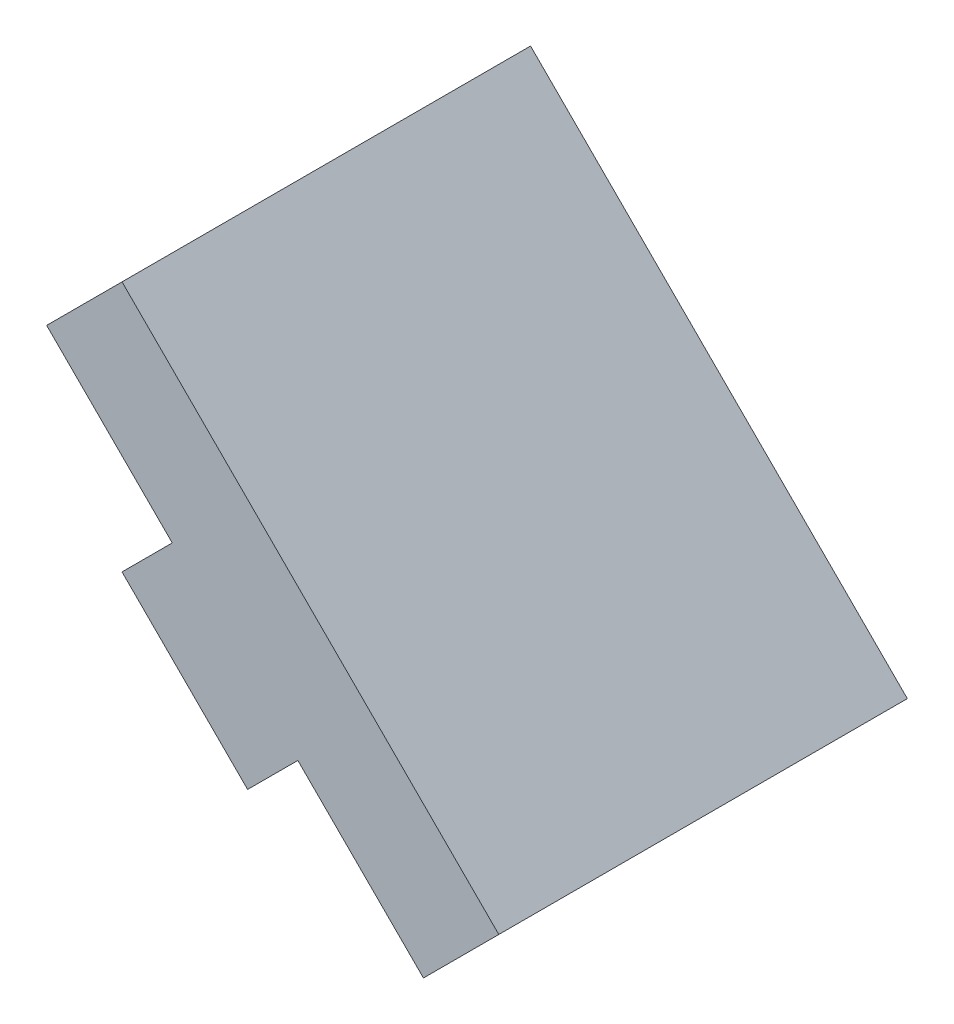
ISO-10303-21;
HEADER;
FILE_DESCRIPTION(('STEP AP214'),'2;1');
FILE_NAME('part.step','',(''),(''),'','','');
FILE_SCHEMA(('AUTOMOTIVE_DESIGN { 1 0 10303 214 1 1 1 1 }'));
ENDSEC;
DATA;
#1=APPLICATION_CONTEXT('core data for automotive mechanical design processes');
#2=APPLICATION_PROTOCOL_DEFINITION('international standard','automotive_design',2000,#1);
#3=PRODUCT_CONTEXT('',#1,'mechanical');
#4=PRODUCT('Part','Part','',(#3));
#5=PRODUCT_RELATED_PRODUCT_CATEGORY('part','',(#4));
#6=PRODUCT_DEFINITION_FORMATION('','',#4);
#7=PRODUCT_DEFINITION_CONTEXT('part definition',#1,'design');
#8=PRODUCT_DEFINITION('design','',#6,#7);
#9=PRODUCT_DEFINITION_SHAPE('','',#8);
#10=(LENGTH_UNIT() NAMED_UNIT(*) SI_UNIT(.MILLI.,.METRE.));
#11=(NAMED_UNIT(*) PLANE_ANGLE_UNIT() SI_UNIT($,.RADIAN.));
#12=(NAMED_UNIT(*) SI_UNIT($,.STERADIAN.) SOLID_ANGLE_UNIT());
#13=UNCERTAINTY_MEASURE_WITH_UNIT(LENGTH_MEASURE(1.E-05),#10,'distance_accuracy_value','');
#14=(GEOMETRIC_REPRESENTATION_CONTEXT(3) GLOBAL_UNCERTAINTY_ASSIGNED_CONTEXT((#13)) GLOBAL_UNIT_ASSIGNED_CONTEXT((#10,
#11,#12)) REPRESENTATION_CONTEXT('',''));
#15=CARTESIAN_POINT('',(0.,0.,0.));
#16=DIRECTION('',(0.,0.,1.));
#17=DIRECTION('',(1.,0.,0.));
#18=AXIS2_PLACEMENT_3D('',#15,#16,#17);
#19=CARTESIAN_POINT('',(8.2052207943,8.541759003165,1.00916));
#20=DIRECTION('',(0.,0.,-1.));
#21=DIRECTION('',(-1.,0.,0.));
#22=AXIS2_PLACEMENT_3D('',#19,#20,#21);
#23=PLANE('',#22);
#24=DIRECTION('',(0.707106781186548,-0.707106781186548,0.));
#25=VECTOR('',#24,1.);
#26=CARTESIAN_POINT('',(8.2052207943,8.541759003165,1.00916));
#27=LINE('',#26,#25);
#28=CARTESIAN_POINT('',(8.01105591591013,8.73592388155412,1.00916));
#29=VERTEX_POINT('',#28);
#30=CARTESIAN_POINT('',(7.79892388155413,8.94805591591012,1.00916));
#31=VERTEX_POINT('',#30);
#32=EDGE_CURVE('E136',#29,#31,#27,.F.);
#33=ORIENTED_EDGE('',*,*,#32,.F.);
#34=DIRECTION('',(-0.707106781186569,-0.707106781186526,0.));
#35=VECTOR('',#34,1.);
#36=CARTESIAN_POINT('',(8.01105591591,8.735923881554,1.00916));
#37=LINE('',#36,#35);
#38=CARTESIAN_POINT('',(7.982771644663,8.707639610307,1.00916));
#39=VERTEX_POINT('',#38);
#40=EDGE_CURVE('E144',#29,#39,#37,.T.);
#41=ORIENTED_EDGE('',*,*,#40,.T.);
#42=DIRECTION('',(-0.707106781186548,0.707106781186548,0.));
#43=VECTOR('',#42,1.);
#44=CARTESIAN_POINT('',(7.982771644663,8.707639610307,1.00916));
#45=LINE('',#44,#43);
#46=CARTESIAN_POINT('',(7.91206096654412,8.77835028842513,1.00916));
#47=VERTEX_POINT('',#46);
#48=EDGE_CURVE('E116',#39,#47,#45,.T.);
#49=ORIENTED_EDGE('',*,*,#48,.T.);
#50=DIRECTION('',(-0.707106781186526,-0.707106781186569,0.));
#51=VECTOR('',#50,1.);
#52=CARTESIAN_POINT('',(7.912060966544,8.778350288425,1.00916));
#53=LINE('',#52,#51);
#54=CARTESIAN_POINT('',(7.883776695297,8.750066017178,1.00916));
#55=VERTEX_POINT('',#54);
#56=EDGE_CURVE('E20',#47,#55,#53,.T.);
#57=ORIENTED_EDGE('',*,*,#56,.T.);
#58=DIRECTION('',(0.707106781186548,-0.707106781186548,0.));
#59=VECTOR('',#58,1.);
#60=CARTESIAN_POINT('',(8.148652251805,8.48519046067,1.00916));
#61=LINE('',#60,#59);
#62=CARTESIAN_POINT('',(7.813066017178,8.820776695297,1.00916));
#63=VERTEX_POINT('',#62);
#64=EDGE_CURVE('E120',#63,#55,#61,.T.);
#65=ORIENTED_EDGE('',*,*,#64,.F.);
#66=DIRECTION('',(0.707106781186548,0.707106781186548,0.));
#67=VECTOR('',#66,1.);
#68=CARTESIAN_POINT('',(7.841350288425,8.849060966544,1.00916));
#69=LINE('',#68,#67);
#70=CARTESIAN_POINT('',(7.84135028842525,8.84906096654425,1.00916));
#71=VERTEX_POINT('',#70);
#72=EDGE_CURVE('E103',#63,#71,#69,.T.);
#73=ORIENTED_EDGE('',*,*,#72,.T.);
#74=DIRECTION('',(-0.707106781186548,0.707106781186548,0.));
#75=VECTOR('',#74,1.);
#76=CARTESIAN_POINT('',(7.770639610307,8.919771644663,1.00916));
#77=LINE('',#76,#75);
#78=CARTESIAN_POINT('',(7.770639610307,8.919771644663,1.00916));
#79=VERTEX_POINT('',#78);
#80=EDGE_CURVE('E109',#71,#79,#77,.T.);
#81=ORIENTED_EDGE('',*,*,#80,.T.);
#82=DIRECTION('',(0.707106781186548,0.707106781186548,0.));
#83=VECTOR('',#82,1.);
#84=CARTESIAN_POINT('',(7.770639610307,8.919771644663,1.00916));
#85=LINE('',#84,#83);
#86=EDGE_CURVE('E145',#79,#31,#85,.T.);
#87=ORIENTED_EDGE('',*,*,#86,.T.);
#88=EDGE_LOOP('',(#33,#41,#49,#57,#65,#73,#81,#87));
#89=FACE_BOUND('',#88,.T.);
#90=ADVANCED_FACE('F17',(#89),#23,.T.);
#91=CARTESIAN_POINT('',(8.113296912745,8.449835121611,0.79916));
#92=DIRECTION('',(-0.707106781186548,-0.707106781186548,0.));
#93=DIRECTION('',(0.707106781186548,-0.707106781186548,0.));
#94=AXIS2_PLACEMENT_3D('',#91,#92,#93);
#95=PLANE('',#94);
#96=DIRECTION('',(0.,0.,1.));
#97=VECTOR('',#96,1.);
#98=CARTESIAN_POINT('',(7.707,8.856132034356,0.79916));
#99=LINE('',#98,#97);
#100=CARTESIAN_POINT('',(7.707,8.856132034356,0.81916));
#101=VERTEX_POINT('',#100);
#102=CARTESIAN_POINT('',(7.707,8.856132034356,0.79916));
#103=VERTEX_POINT('',#102);
#104=EDGE_CURVE('E142',#101,#103,#99,.F.);
#105=ORIENTED_EDGE('',*,*,#104,.T.);
#106=DIRECTION('',(-0.707106781186548,0.707106781186548,0.));
#107=VECTOR('',#106,1.);
#108=CARTESIAN_POINT('',(7.919132034356,8.644,0.79916));
#109=LINE('',#108,#107);
#110=CARTESIAN_POINT('',(7.919132034356,8.644,0.79916));
#111=VERTEX_POINT('',#110);
#112=EDGE_CURVE('E177',#111,#103,#109,.T.);
#113=ORIENTED_EDGE('',*,*,#112,.F.);
#114=DIRECTION('',(0.,0.,1.));
#115=VECTOR('',#114,1.);
#116=CARTESIAN_POINT('',(7.919132034356,8.644,1.00916));
#117=LINE('',#116,#115);
#118=CARTESIAN_POINT('',(7.919132034356,8.644,0.81916));
#119=VERTEX_POINT('',#118);
#120=EDGE_CURVE('E163',#111,#119,#117,.T.);
#121=ORIENTED_EDGE('',*,*,#120,.T.);
#122=DIRECTION('',(0.707106781186548,-0.707106781186548,0.));
#123=VECTOR('',#122,1.);
#124=CARTESIAN_POINT('',(7.707,8.856132034356,0.81916));
#125=LINE('',#124,#123);
#126=EDGE_CURVE('E139',#101,#119,#125,.T.);
#127=ORIENTED_EDGE('',*,*,#126,.F.);
#128=EDGE_LOOP('',(#105,#113,#121,#127));
#129=FACE_BOUND('',#128,.T.);
#130=ADVANCED_FACE('F219',(#129),#95,.T.);
#131=CARTESIAN_POINT('',(8.113296912745,8.449835121611,0.81916));
#132=DIRECTION('',(0.,0.,1.));
#133=DIRECTION('',(1.,0.,0.));
#134=AXIS2_PLACEMENT_3D('',#131,#132,#133);
#135=PLANE('',#134);
#136=DIRECTION('',(-0.707106781186548,-0.707106781186548,0.));
#137=VECTOR('',#136,1.);
#138=CARTESIAN_POINT('',(7.600933982822,8.750066017178,0.81916));
#139=LINE('',#138,#137);
#140=CARTESIAN_POINT('',(7.79892388155413,8.94805591591012,0.81916));
#141=VERTEX_POINT('',#140);
#142=EDGE_CURVE('E184',#101,#141,#139,.F.);
#143=ORIENTED_EDGE('',*,*,#142,.F.);
#144=ORIENTED_EDGE('',*,*,#126,.T.);
#145=DIRECTION('',(-0.707106781186548,-0.707106781186548,0.));
#146=VECTOR('',#145,1.);
#147=CARTESIAN_POINT('',(7.615076118446,8.33994408409,0.81916));
#148=LINE('',#147,#146);
#149=CARTESIAN_POINT('',(8.01105591591013,8.73592388155412,0.81916));
#150=VERTEX_POINT('',#149);
#151=EDGE_CURVE('E167',#119,#150,#148,.F.);
#152=ORIENTED_EDGE('',*,*,#151,.T.);
#153=DIRECTION('',(0.707106781186548,-0.707106781186548,0.));
#154=VECTOR('',#153,1.);
#155=CARTESIAN_POINT('',(8.2052207943,8.541759003165,0.81916));
#156=LINE('',#155,#154);
#157=EDGE_CURVE('E133',#141,#150,#156,.T.);
#158=ORIENTED_EDGE('',*,*,#157,.F.);
#159=EDGE_LOOP('',(#143,#144,#152,#158));
#160=FACE_BOUND('',#159,.T.);
#161=ADVANCED_FACE('F223',(#160),#135,.T.);
#162=CARTESIAN_POINT('',(8.2052207943,8.541759003165,0.81916));
#163=DIRECTION('',(-0.707106781186548,-0.707106781186548,0.));
#164=DIRECTION('',(0.707106781186548,-0.707106781186548,0.));
#165=AXIS2_PLACEMENT_3D('',#162,#163,#164);
#166=PLANE('',#165);
#167=DIRECTION('',(0.,0.,1.));
#168=VECTOR('',#167,1.);
#169=CARTESIAN_POINT('',(7.798923881554,8.94805591591,0.81916));
#170=LINE('',#169,#168);
#171=EDGE_CURVE('E187',#141,#31,#170,.T.);
#172=ORIENTED_EDGE('',*,*,#171,.F.);
#173=ORIENTED_EDGE('',*,*,#157,.T.);
#174=DIRECTION('',(0.,0.,1.));
#175=VECTOR('',#174,1.);
#176=CARTESIAN_POINT('',(8.01105591591,8.735923881554,1.00916));
#177=LINE('',#176,#175);
#178=EDGE_CURVE('E169',#150,#29,#177,.T.);
#179=ORIENTED_EDGE('',*,*,#178,.T.);
#180=ORIENTED_EDGE('',*,*,#32,.T.);
#181=EDGE_LOOP('',(#172,#173,#179,#180));
#182=FACE_BOUND('',#181,.T.);
#183=ADVANCED_FACE('F226',(#182),#166,.T.);
#184=CARTESIAN_POINT('',(7.982771644663,8.707639610307,0.901456703857));
#185=DIRECTION('',(0.707106781186548,0.707106781186548,0.));
#186=DIRECTION('',(-0.707106781186548,0.707106781186548,0.));
#187=AXIS2_PLACEMENT_3D('',#184,#185,#186);
#188=PLANE('',#187);
#189=DIRECTION('',(0.,0.,1.));
#190=VECTOR('',#189,1.);
#191=CARTESIAN_POINT('',(7.982771644663,8.707639610307,1.00916));
#192=LINE('',#191,#190);
#193=CARTESIAN_POINT('',(7.982771644663,8.707639610307,1.02916));
#194=VERTEX_POINT('',#193);
#195=EDGE_CURVE('E172',#39,#194,#192,.T.);
#196=ORIENTED_EDGE('',*,*,#195,.T.);
#197=DIRECTION('',(0.707106781191544,-0.707106781181552,0.));
#198=VECTOR('',#197,1.);
#199=CARTESIAN_POINT('',(7.912060966544,8.778350288425,1.02916));
#200=LINE('',#199,#198);
#201=CARTESIAN_POINT('',(7.91206096654425,8.77835028842525,1.02916));
#202=VERTEX_POINT('',#201);
#203=EDGE_CURVE('E190',#202,#194,#200,.T.);
#204=ORIENTED_EDGE('',*,*,#203,.F.);
#205=DIRECTION('',(0.,0.,1.));
#206=VECTOR('',#205,1.);
#207=CARTESIAN_POINT('',(7.912060966544,8.778350288425,0.901456703857));
#208=LINE('',#207,#206);
#209=EDGE_CURVE('E161',#202,#47,#208,.F.);
#210=ORIENTED_EDGE('',*,*,#209,.T.);
#211=ORIENTED_EDGE('',*,*,#48,.F.);
#212=EDGE_LOOP('',(#196,#204,#210,#211));
#213=FACE_BOUND('',#212,.T.);
#214=ADVANCED_FACE('F231',(#213),#188,.F.);
#215=CARTESIAN_POINT('',(7.770639610307,8.919771644663,0.901456703857));
#216=DIRECTION('',(0.707106781186548,0.707106781186548,0.));
#217=DIRECTION('',(-0.707106781186548,0.707106781186548,0.));
#218=AXIS2_PLACEMENT_3D('',#215,#216,#217);
#219=PLANE('',#218);
#220=DIRECTION('',(0.,0.,1.));
#221=VECTOR('',#220,1.);
#222=CARTESIAN_POINT('',(7.841350288425,8.849060966544,0.901456703857));
#223=LINE('',#222,#221);
#224=CARTESIAN_POINT('',(7.84135028842525,8.84906096654425,1.02916));
#225=VERTEX_POINT('',#224);
#226=EDGE_CURVE('E112',#71,#225,#223,.T.);
#227=ORIENTED_EDGE('',*,*,#226,.T.);
#228=DIRECTION('',(0.707106781181547,-0.707106781191548,0.));
#229=VECTOR('',#228,1.);
#230=CARTESIAN_POINT('',(7.770639610307,8.919771644663,1.02916));
#231=LINE('',#230,#229);
#232=CARTESIAN_POINT('',(7.770639610307,8.919771644663,1.02916));
#233=VERTEX_POINT('',#232);
#234=EDGE_CURVE('E197',#233,#225,#231,.T.);
#235=ORIENTED_EDGE('',*,*,#234,.F.);
#236=DIRECTION('',(0.,0.,1.));
#237=VECTOR('',#236,1.);
#238=CARTESIAN_POINT('',(7.770639610307,8.919771644663,0.81916));
#239=LINE('',#238,#237);
#240=EDGE_CURVE('E114',#79,#233,#239,.T.);
#241=ORIENTED_EDGE('',*,*,#240,.F.);
#242=ORIENTED_EDGE('',*,*,#80,.F.);
#243=EDGE_LOOP('',(#227,#235,#241,#242));
#244=FACE_BOUND('',#243,.T.);
#245=ADVANCED_FACE('F110',(#244),#219,.F.);
#246=CARTESIAN_POINT('',(7.841350288425,8.849060966544,0.901456703857));
#247=DIRECTION('',(0.707106781186548,-0.707106781186548,0.));
#248=DIRECTION('',(0.707106781186548,0.707106781186548,0.));
#249=AXIS2_PLACEMENT_3D('',#246,#247,#248);
#250=PLANE('',#249);
#251=DIRECTION('',(0.,0.,1.));
#252=VECTOR('',#251,1.);
#253=CARTESIAN_POINT('',(7.813066017178,8.820776695297,1.00916));
#254=LINE('',#253,#252);
#255=CARTESIAN_POINT('',(7.813066017178,8.820776695297,1.02916));
#256=VERTEX_POINT('',#255);
#257=EDGE_CURVE('E122',#256,#63,#254,.F.);
#258=ORIENTED_EDGE('',*,*,#257,.F.);
#259=DIRECTION('',(-0.707106781186548,-0.707106781186548,0.));
#260=VECTOR('',#259,1.);
#261=CARTESIAN_POINT('',(7.841350288425,8.849060966544,1.02916));
#262=LINE('',#261,#260);
#263=EDGE_CURVE('E126',#225,#256,#262,.T.);
#264=ORIENTED_EDGE('',*,*,#263,.F.);
#265=ORIENTED_EDGE('',*,*,#226,.F.);
#266=ORIENTED_EDGE('',*,*,#72,.F.);
#267=EDGE_LOOP('',(#258,#264,#265,#266));
#268=FACE_BOUND('',#267,.T.);
#269=ADVANCED_FACE('F124',(#268),#250,.F.);
#270=CARTESIAN_POINT('',(8.148652251805,8.48519046067,1.00916));
#271=DIRECTION('',(-0.707106781186548,-0.707106781186548,0.));
#272=DIRECTION('',(0.707106781186548,-0.707106781186548,0.));
#273=AXIS2_PLACEMENT_3D('',#270,#271,#272);
#274=PLANE('',#273);
#275=ORIENTED_EDGE('',*,*,#257,.T.);
#276=ORIENTED_EDGE('',*,*,#64,.T.);
#277=DIRECTION('',(0.,0.,1.));
#278=VECTOR('',#277,1.);
#279=CARTESIAN_POINT('',(7.883776695297,8.750066017178,0.901456703857));
#280=LINE('',#279,#278);
#281=CARTESIAN_POINT('',(7.883776695297,8.750066017178,1.02916));
#282=VERTEX_POINT('',#281);
#283=EDGE_CURVE('E154',#55,#282,#280,.T.);
#284=ORIENTED_EDGE('',*,*,#283,.T.);
#285=DIRECTION('',(0.70710678118653,-0.707106781186565,0.));
#286=VECTOR('',#285,1.);
#287=CARTESIAN_POINT('',(7.813066017178,8.820776695297,1.02916));
#288=LINE('',#287,#286);
#289=EDGE_CURVE('E200',#256,#282,#288,.T.);
#290=ORIENTED_EDGE('',*,*,#289,.F.);
#291=EDGE_LOOP('',(#275,#276,#284,#290));
#292=FACE_BOUND('',#291,.T.);
#293=ADVANCED_FACE('F152',(#292),#274,.T.);
#294=CARTESIAN_POINT('',(7.912060966544,8.778350288425,0.901456703857));
#295=DIRECTION('',(-0.707106781186548,0.707106781186548,0.));
#296=DIRECTION('',(-0.707106781186548,-0.707106781186548,0.));
#297=AXIS2_PLACEMENT_3D('',#294,#295,#296);
#298=PLANE('',#297);
#299=ORIENTED_EDGE('',*,*,#209,.F.);
#300=DIRECTION('',(0.707106781186526,0.707106781186569,0.));
#301=VECTOR('',#300,1.);
#302=CARTESIAN_POINT('',(7.883776695297,8.750066017178,1.02916));
#303=LINE('',#302,#301);
#304=EDGE_CURVE('E159',#282,#202,#303,.T.);
#305=ORIENTED_EDGE('',*,*,#304,.F.);
#306=ORIENTED_EDGE('',*,*,#283,.F.);
#307=ORIENTED_EDGE('',*,*,#56,.F.);
#308=EDGE_LOOP('',(#299,#305,#306,#307));
#309=FACE_BOUND('',#308,.T.);
#310=ADVANCED_FACE('F157',(#309),#298,.F.);
#311=CARTESIAN_POINT('',(7.615076118446,8.33994408409,1.00916));
#312=DIRECTION('',(-0.707106781186548,0.707106781186548,0.));
#313=DIRECTION('',(-0.707106781186548,-0.707106781186548,0.));
#314=AXIS2_PLACEMENT_3D('',#311,#312,#313);
#315=PLANE('',#314);
#316=ORIENTED_EDGE('',*,*,#195,.F.);
#317=ORIENTED_EDGE('',*,*,#40,.F.);
#318=ORIENTED_EDGE('',*,*,#178,.F.);
#319=ORIENTED_EDGE('',*,*,#151,.F.);
#320=ORIENTED_EDGE('',*,*,#120,.F.);
#321=DIRECTION('',(-0.707106781186553,-0.707106781186542,0.));
#322=VECTOR('',#321,1.);
#323=CARTESIAN_POINT('',(8.025198051534,8.750066017178,0.79916));
#324=LINE('',#323,#322);
#325=CARTESIAN_POINT('',(8.025198051534,8.750066017178,0.79916));
#326=VERTEX_POINT('',#325);
#327=EDGE_CURVE('E174',#326,#111,#324,.T.);
#328=ORIENTED_EDGE('',*,*,#327,.F.);
#329=DIRECTION('',(0.,0.,1.));
#330=VECTOR('',#329,1.);
#331=CARTESIAN_POINT('',(8.025198051534,8.750066017178,1.02916));
#332=LINE('',#331,#330);
#333=CARTESIAN_POINT('',(8.025198051534,8.750066017178,1.02916));
#334=VERTEX_POINT('',#333);
#335=EDGE_CURVE('E203',#334,#326,#332,.F.);
#336=ORIENTED_EDGE('',*,*,#335,.F.);
#337=DIRECTION('',(0.707106781186562,0.707106781186533,0.));
#338=VECTOR('',#337,1.);
#339=CARTESIAN_POINT('',(7.982771644663,8.707639610307,1.02916));
#340=LINE('',#339,#338);
#341=EDGE_CURVE('E193',#194,#334,#340,.T.);
#342=ORIENTED_EDGE('',*,*,#341,.F.);
#343=EDGE_LOOP('',(#316,#317,#318,#319,#320,#328,#336,#342));
#344=FACE_BOUND('',#343,.T.);
#345=ADVANCED_FACE('F233',(#344),#315,.F.);
#346=CARTESIAN_POINT('',(8.219362929923,8.555901138789,0.79916));
#347=DIRECTION('',(0.,0.,-1.));
#348=DIRECTION('',(-1.,0.,0.));
#349=AXIS2_PLACEMENT_3D('',#346,#347,#348);
#350=PLANE('',#349);
#351=DIRECTION('',(-0.707106781186548,-0.707106781186548,0.));
#352=VECTOR('',#351,1.);
#353=CARTESIAN_POINT('',(7.600933982822,8.750066017178,0.79916));
#354=LINE('',#353,#352);
#355=CARTESIAN_POINT('',(7.813066017178,8.962198051534,0.79916));
#356=VERTEX_POINT('',#355);
#357=EDGE_CURVE('E181',#356,#103,#354,.T.);
#358=ORIENTED_EDGE('',*,*,#357,.F.);
#359=DIRECTION('',(-0.707106781186548,0.707106781186548,0.));
#360=VECTOR('',#359,1.);
#361=CARTESIAN_POINT('',(8.219362929923,8.555901138789,0.79916));
#362=LINE('',#361,#360);
#363=EDGE_CURVE('E206',#326,#356,#362,.T.);
#364=ORIENTED_EDGE('',*,*,#363,.F.);
#365=ORIENTED_EDGE('',*,*,#327,.T.);
#366=ORIENTED_EDGE('',*,*,#112,.T.);
#367=EDGE_LOOP('',(#358,#364,#365,#366));
#368=FACE_BOUND('',#367,.T.);
#369=ADVANCED_FACE('F216',(#368),#350,.T.);
#370=CARTESIAN_POINT('',(7.600933982822,8.750066017178,0.81916));
#371=DIRECTION('',(-0.707106781186548,0.707106781186548,0.));
#372=DIRECTION('',(-0.707106781186548,-0.707106781186548,0.));
#373=AXIS2_PLACEMENT_3D('',#370,#371,#372);
#374=PLANE('',#373);
#375=ORIENTED_EDGE('',*,*,#171,.T.);
#376=ORIENTED_EDGE('',*,*,#86,.F.);
#377=ORIENTED_EDGE('',*,*,#240,.T.);
#378=DIRECTION('',(-0.707106781186569,-0.707106781186526,0.));
#379=VECTOR('',#378,1.);
#380=CARTESIAN_POINT('',(7.813066017178,8.962198051534,1.02916));
#381=LINE('',#380,#379);
#382=CARTESIAN_POINT('',(7.813066017178,8.962198051534,1.02916));
#383=VERTEX_POINT('',#382);
#384=EDGE_CURVE('E35',#383,#233,#381,.T.);
#385=ORIENTED_EDGE('',*,*,#384,.F.);
#386=DIRECTION('',(0.,0.,1.));
#387=VECTOR('',#386,1.);
#388=CARTESIAN_POINT('',(7.813066017178,8.962198051534,1.02916));
#389=LINE('',#388,#387);
#390=EDGE_CURVE('E26',#356,#383,#389,.T.);
#391=ORIENTED_EDGE('',*,*,#390,.F.);
#392=ORIENTED_EDGE('',*,*,#357,.T.);
#393=ORIENTED_EDGE('',*,*,#104,.F.);
#394=ORIENTED_EDGE('',*,*,#142,.T.);
#395=EDGE_LOOP('',(#375,#376,#377,#385,#391,#392,#393,#394));
#396=FACE_BOUND('',#395,.T.);
#397=ADVANCED_FACE('F213',(#396),#374,.T.);
#398=CARTESIAN_POINT('',(8.148652251805,8.48519046067,1.02916));
#399=DIRECTION('',(0.,0.,1.));
#400=DIRECTION('',(1.,0.,0.));
#401=AXIS2_PLACEMENT_3D('',#398,#399,#400);
#402=PLANE('',#401);
#403=ORIENTED_EDGE('',*,*,#289,.T.);
#404=ORIENTED_EDGE('',*,*,#304,.T.);
#405=ORIENTED_EDGE('',*,*,#203,.T.);
#406=ORIENTED_EDGE('',*,*,#341,.T.);
#407=DIRECTION('',(-0.707106781186548,0.707106781186548,0.));
#408=VECTOR('',#407,1.);
#409=CARTESIAN_POINT('',(8.219362929923,8.555901138789,1.02916));
#410=LINE('',#409,#408);
#411=EDGE_CURVE('E11',#383,#334,#410,.F.);
#412=ORIENTED_EDGE('',*,*,#411,.F.);
#413=ORIENTED_EDGE('',*,*,#384,.T.);
#414=ORIENTED_EDGE('',*,*,#234,.T.);
#415=ORIENTED_EDGE('',*,*,#263,.T.);
#416=EDGE_LOOP('',(#403,#404,#405,#406,#412,#413,#414,#415));
#417=FACE_BOUND('',#416,.T.);
#418=ADVANCED_FACE('F235',(#417),#402,.T.);
#419=CARTESIAN_POINT('',(8.219362929923,8.555901138789,1.02916));
#420=DIRECTION('',(0.707106781186548,0.707106781186548,0.));
#421=DIRECTION('',(-0.707106781186548,0.707106781186548,0.));
#422=AXIS2_PLACEMENT_3D('',#419,#420,#421);
#423=PLANE('',#422);
#424=ORIENTED_EDGE('',*,*,#390,.T.);
#425=ORIENTED_EDGE('',*,*,#411,.T.);
#426=ORIENTED_EDGE('',*,*,#335,.T.);
#427=ORIENTED_EDGE('',*,*,#363,.T.);
#428=EDGE_LOOP('',(#424,#425,#426,#427));
#429=FACE_BOUND('',#428,.T.);
#430=ADVANCED_FACE('F211',(#429),#423,.T.);
#431=CLOSED_SHELL('',(#90,#130,#161,#183,#214,#245,#269,#293,#310,#345,#369,#397,#418,#430));
#432=MANIFOLD_SOLID_BREP('B1',#431);
#433=ADVANCED_BREP_SHAPE_REPRESENTATION('',(#18,#432),#14);
#434=SHAPE_DEFINITION_REPRESENTATION(#9,#433);
ENDSEC;
END-ISO-10303-21;
